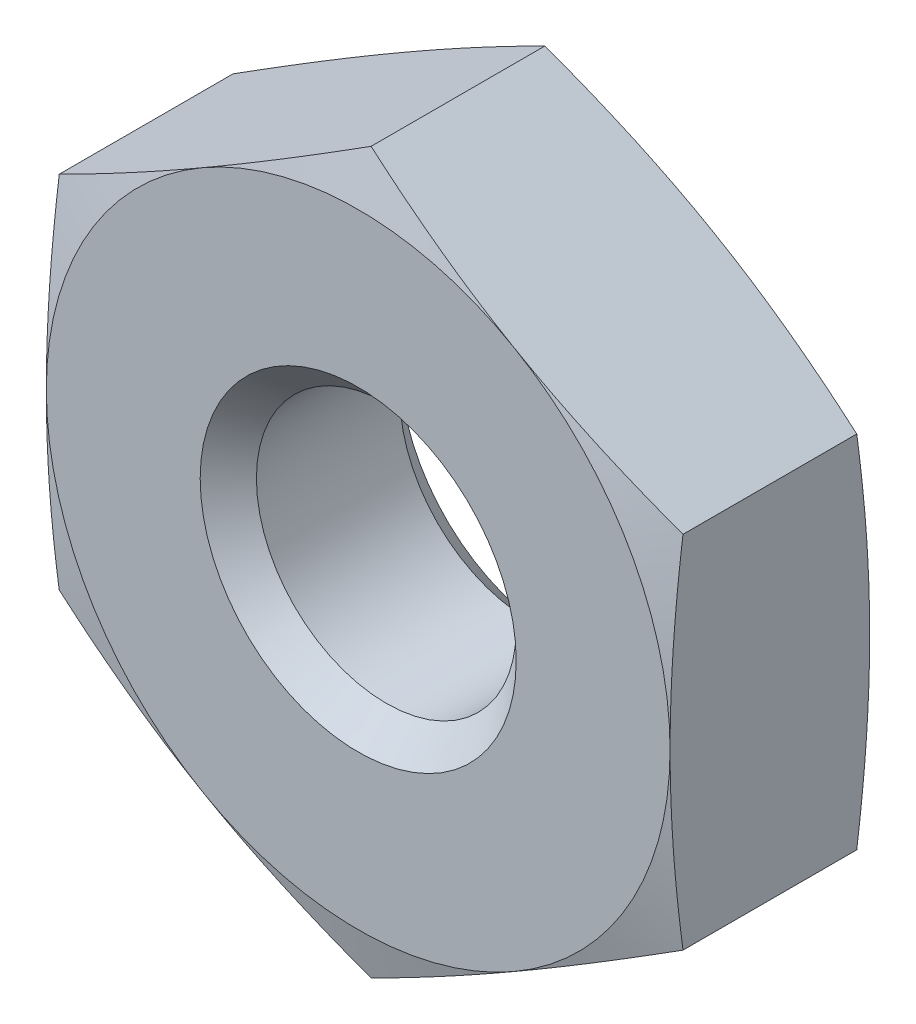
ISO-10303-21;
HEADER;
FILE_DESCRIPTION(('STEP AP214'),'2;1');
FILE_NAME('part.step','',(''),(''),'','','');
FILE_SCHEMA(('AUTOMOTIVE_DESIGN { 1 0 10303 214 1 1 1 1 }'));
ENDSEC;
DATA;
#1=APPLICATION_CONTEXT('core data for automotive mechanical design processes');
#2=APPLICATION_PROTOCOL_DEFINITION('international standard','automotive_design',2000,#1);
#3=PRODUCT_CONTEXT('',#1,'mechanical');
#4=PRODUCT('Part','Part','',(#3));
#5=PRODUCT_RELATED_PRODUCT_CATEGORY('part','',(#4));
#6=PRODUCT_DEFINITION_FORMATION('','',#4);
#7=PRODUCT_DEFINITION_CONTEXT('part definition',#1,'design');
#8=PRODUCT_DEFINITION('design','',#6,#7);
#9=PRODUCT_DEFINITION_SHAPE('','',#8);
#10=(LENGTH_UNIT() NAMED_UNIT(*) SI_UNIT(.MILLI.,.METRE.));
#11=(NAMED_UNIT(*) PLANE_ANGLE_UNIT() SI_UNIT($,.RADIAN.));
#12=(NAMED_UNIT(*) SI_UNIT($,.STERADIAN.) SOLID_ANGLE_UNIT());
#13=UNCERTAINTY_MEASURE_WITH_UNIT(LENGTH_MEASURE(1.E-05),#10,'distance_accuracy_value','');
#14=(GEOMETRIC_REPRESENTATION_CONTEXT(3) GLOBAL_UNCERTAINTY_ASSIGNED_CONTEXT((#13)) GLOBAL_UNIT_ASSIGNED_CONTEXT((#10,
#11,#12)) REPRESENTATION_CONTEXT('',''));
#15=CARTESIAN_POINT('',(0.,0.,0.));
#16=DIRECTION('',(0.,0.,1.));
#17=DIRECTION('',(1.,0.,0.));
#18=AXIS2_PLACEMENT_3D('',#15,#16,#17);
#19=CARTESIAN_POINT('',(0.,0.,0.));
#20=DIRECTION('',(0.,0.,-1.));
#21=DIRECTION('',(-1.,0.,0.));
#22=AXIS2_PLACEMENT_3D('',#19,#20,#21);
#23=PLANE('',#22);
#24=CARTESIAN_POINT('',(0.,0.,0.));
#25=DIRECTION('',(0.,0.,1.));
#26=DIRECTION('',(1.,0.,0.));
#27=AXIS2_PLACEMENT_3D('',#24,#25,#26);
#28=CIRCLE('',#27,2.41299999999001);
#29=CARTESIAN_POINT('',(2.41299999999001,0.,0.));
#30=VERTEX_POINT('',#29);
#31=EDGE_CURVE('E19',#30,#30,#28,.F.);
#32=ORIENTED_EDGE('',*,*,#31,.T.);
#33=EDGE_LOOP('',(#32));
#34=FACE_BOUND('',#33,.T.);
#35=CARTESIAN_POINT('',(0.,0.,0.));
#36=DIRECTION('',(0.,0.,-1.));
#37=DIRECTION('',(0.,1.,0.));
#38=AXIS2_PLACEMENT_3D('',#35,#36,#37);
#39=CIRCLE('',#38,4.7624999999698);
#40=CARTESIAN_POINT('',(-4.7624999999849,0.,-4.04533606351852E-12));
#41=VERTEX_POINT('',#40);
#42=CARTESIAN_POINT('',(-2.38124999999246,4.12444598551032,-4.04657973044043E-12));
#43=VERTEX_POINT('',#42);
#44=EDGE_CURVE('E129',#41,#43,#39,.T.);
#45=ORIENTED_EDGE('',*,*,#44,.F.);
#46=CARTESIAN_POINT('',(0.,0.,0.));
#47=DIRECTION('',(0.,0.,-1.));
#48=DIRECTION('',(0.,1.,0.));
#49=AXIS2_PLACEMENT_3D('',#46,#47,#48);
#50=CIRCLE('',#49,4.7624999999698);
#51=CARTESIAN_POINT('',(-2.38124999999245,-4.12444598551032,-4.04580046008107E-12));
#52=VERTEX_POINT('',#51);
#53=EDGE_CURVE('E127',#52,#41,#50,.T.);
#54=ORIENTED_EDGE('',*,*,#53,.F.);
#55=CARTESIAN_POINT('',(0.,0.,0.));
#56=DIRECTION('',(0.,0.,-1.));
#57=DIRECTION('',(0.,1.,0.));
#58=AXIS2_PLACEMENT_3D('',#55,#56,#57);
#59=CIRCLE('',#58,4.7624999999698);
#60=CARTESIAN_POINT('',(2.38124999999246,-4.12444598551031,-4.04656131367248E-12));
#61=VERTEX_POINT('',#60);
#62=EDGE_CURVE('E109',#61,#52,#59,.T.);
#63=ORIENTED_EDGE('',*,*,#62,.F.);
#64=CARTESIAN_POINT('',(0.,0.,0.));
#65=DIRECTION('',(0.,0.,-1.));
#66=DIRECTION('',(0.,1.,0.));
#67=AXIS2_PLACEMENT_3D('',#64,#65,#66);
#68=CIRCLE('',#67,4.7624999999698);
#69=CARTESIAN_POINT('',(4.7624999999849,0.,-4.04533558540813E-12));
#70=VERTEX_POINT('',#69);
#71=EDGE_CURVE('E102',#70,#61,#68,.T.);
#72=ORIENTED_EDGE('',*,*,#71,.F.);
#73=CARTESIAN_POINT('',(0.,0.,0.));
#74=DIRECTION('',(0.,0.,-1.));
#75=DIRECTION('',(0.,1.,0.));
#76=AXIS2_PLACEMENT_3D('',#73,#74,#75);
#77=CIRCLE('',#76,4.7624999999698);
#78=CARTESIAN_POINT('',(2.38124999999245,4.12444598551031,-4.04582372559714E-12));
#79=VERTEX_POINT('',#78);
#80=EDGE_CURVE('E424',#79,#70,#77,.T.);
#81=ORIENTED_EDGE('',*,*,#80,.F.);
#82=CARTESIAN_POINT('',(0.,0.,0.));
#83=DIRECTION('',(0.,0.,-1.));
#84=DIRECTION('',(0.,1.,0.));
#85=AXIS2_PLACEMENT_3D('',#82,#83,#84);
#86=CIRCLE('',#85,4.7624999999698);
#87=EDGE_CURVE('E134',#43,#79,#86,.T.);
#88=ORIENTED_EDGE('',*,*,#87,.F.);
#89=EDGE_LOOP('',(#45,#54,#63,#72,#81,#88));
#90=FACE_BOUND('',#89,.T.);
#91=ADVANCED_FACE('F16',(#34,#90),#23,.F.);
#92=CARTESIAN_POINT('',(0.,0.,0.));
#93=DIRECTION('',(0.,0.,1.));
#94=DIRECTION('',(1.,0.,0.));
#95=AXIS2_PLACEMENT_3D('',#92,#93,#94);
#96=CONICAL_SURFACE('',#95,2.41299999999001,0.785398163397448);
#97=ORIENTED_EDGE('',*,*,#31,.F.);
#98=EDGE_LOOP('',(#97));
#99=FACE_BOUND('',#98,.T.);
#100=CARTESIAN_POINT('',(0.,0.,-0.42926));
#101=DIRECTION('',(0.,0.,1.));
#102=DIRECTION('',(1.,0.,0.));
#103=AXIS2_PLACEMENT_3D('',#100,#101,#102);
#104=CIRCLE('',#103,1.98374);
#105=CARTESIAN_POINT('',(1.98374,0.,-0.42926));
#106=VERTEX_POINT('',#105);
#107=EDGE_CURVE('E124',#106,#106,#104,.F.);
#108=ORIENTED_EDGE('',*,*,#107,.T.);
#109=EDGE_LOOP('',(#108));
#110=FACE_BOUND('',#109,.T.);
#111=ADVANCED_FACE('F396',(#99,#110),#96,.F.);
#112=CARTESIAN_POINT('',(0.,0.,-0.198599086729701));
#113=DIRECTION('',(0.,0.,-1.));
#114=DIRECTION('',(0.,1.,0.));
#115=AXIS2_PLACEMENT_3D('',#112,#113,#114);
#116=CONICAL_SURFACE('',#115,5.50368188197581,1.30899693899372);
#117=ORIENTED_EDGE('',*,*,#62,.T.);
#118=CARTESIAN_POINT('',(-1.10100781708096E-12,-5.49926131403055,-0.197414599118673));
#119=CARTESIAN_POINT('',(-0.197405840343341,-5.38528899896936,-0.166865512952063));
#120=CARTESIAN_POINT('',(-0.395166009137093,-5.2711121122813,-0.139125457541238));
#121=CARTESIAN_POINT('',(-0.791077990089859,-5.04253222350282,-0.0904103419889045));
#122=CARTESIAN_POINT('',(-0.989229100594217,-4.92812962651291,-0.0694276203508561));
#123=CARTESIAN_POINT('',(-1.38610237940164,-4.69899473215927,-0.0352954826427711));
#124=CARTESIAN_POINT('',(-1.58482467133357,-4.58426236341839,-0.022147914684576));
#125=CARTESIAN_POINT('',(-1.88322873930389,-4.41197869444845,-0.0089070268822042));
#126=CARTESIAN_POINT('',(-1.98280832106101,-4.35448639611518,-0.00557342497592602));
#127=CARTESIAN_POINT('',(-2.18200766587997,-4.23947860076156,-0.00111726033218135));
#128=CARTESIAN_POINT('',(-2.28162743013149,-4.18196310305434,5.23126526352427E-06));
#129=CARTESIAN_POINT('',(-2.38125,-4.12444598552339,-8.09156365887653E-12));
#130=B_SPLINE_CURVE_WITH_KNOTS('',3,(#118,#119,#120,#121,#122,#123,#124,#125,#126,#127,#128,
#129),.UNSPECIFIED.,.F.,.F.,(4,2,2,2,2,4),(0.,0.68997774530214,1.37917041365534,
2.06852558060972,2.41360556986701,2.75869666150886),.UNSPECIFIED.);
#131=CARTESIAN_POINT('',(0.,-5.49926131403055,-0.197414599118673));
#132=VERTEX_POINT('',#131);
#133=EDGE_CURVE('E112',#132,#52,#130,.T.);
#134=ORIENTED_EDGE('',*,*,#133,.F.);
#135=CARTESIAN_POINT('',(2.38125000000001,-4.1244459855234,-8.09310346985567E-12));
#136=CARTESIAN_POINT('',(2.2816274301315,-4.18196310305434,5.23126526195123E-06));
#137=CARTESIAN_POINT('',(2.18200766587997,-4.23947860076157,-0.00111726033218282));
#138=CARTESIAN_POINT('',(1.98280832106102,-4.35448639611519,-0.00557342497592722));
#139=CARTESIAN_POINT('',(1.8832287393039,-4.41197869444845,-0.00890702688220526));
#140=CARTESIAN_POINT('',(1.58482467133357,-4.5842623634184,-0.0221479146845768));
#141=CARTESIAN_POINT('',(1.38610237940164,-4.69899473215928,-0.0352954826427721));
#142=CARTESIAN_POINT('',(0.989229100594223,-4.92812962651291,-0.0694276203508573));
#143=CARTESIAN_POINT('',(0.791077990089865,-5.04253222350282,-0.0904103419889056));
#144=CARTESIAN_POINT('',(0.395166009137099,-5.2711121122813,-0.139125457541239));
#145=CARTESIAN_POINT('',(0.197405840343347,-5.38528899896936,-0.166865512952064));
#146=CARTESIAN_POINT('',(1.10691644819718E-12,-5.49926131403056,-0.197414599118673));
#147=B_SPLINE_CURVE_WITH_KNOTS('',3,(#135,#136,#137,#138,#139,#140,#141,#142,#143,#144,#145,
#146),.UNSPECIFIED.,.F.,.F.,(4,2,2,2,2,4),(0.,0.345091091641847,0.690171080899136,
1.37952624785352,2.06871891620672,2.75869666150886),.UNSPECIFIED.);
#148=EDGE_CURVE('E114',#61,#132,#147,.T.);
#149=ORIENTED_EDGE('',*,*,#148,.F.);
#150=EDGE_LOOP('',(#117,#134,#149));
#151=FACE_BOUND('',#150,.T.);
#152=ADVANCED_FACE('F111',(#151),#116,.T.);
#153=CARTESIAN_POINT('',(0.,0.,-0.198599086729701));
#154=DIRECTION('',(0.,0.,-1.));
#155=DIRECTION('',(0.,1.,0.));
#156=AXIS2_PLACEMENT_3D('',#153,#154,#155);
#157=CONICAL_SURFACE('',#156,5.50368188197581,1.30899693899372);
#158=ORIENTED_EDGE('',*,*,#71,.T.);
#159=CARTESIAN_POINT('',(4.7624999999989,-2.74963065701624,-0.197414599118673));
#160=CARTESIAN_POINT('',(4.56509415965666,-2.86360297207744,-0.166865512952064));
#161=CARTESIAN_POINT('',(4.36733399086291,-2.97777985876549,-0.139125457541239));
#162=CARTESIAN_POINT('',(3.97142200991014,-3.20635974754397,-0.0904103419889058));
#163=CARTESIAN_POINT('',(3.77327089940579,-3.32076234453388,-0.0694276203508575));
#164=CARTESIAN_POINT('',(3.37639762059837,-3.54989723888751,-0.0352954826427724));
#165=CARTESIAN_POINT('',(3.17767532866644,-3.66462960762839,-0.0221479146845772));
#166=CARTESIAN_POINT('',(2.87927126069612,-3.83691327659834,-0.00890702688220558));
#167=CARTESIAN_POINT('',(2.77969167893899,-3.8944055749316,-0.00557342497592748));
#168=CARTESIAN_POINT('',(2.58049233412004,-4.00941337028522,-0.00111726033218291));
#169=CARTESIAN_POINT('',(2.48087256986852,-4.06692886799245,5.23126526196898E-06));
#170=CARTESIAN_POINT('',(2.38125000000001,-4.1244459855234,-8.09294901954408E-12));
#171=B_SPLINE_CURVE_WITH_KNOTS('',3,(#159,#160,#161,#162,#163,#164,#165,#166,#167,#168,#169,
#170),.UNSPECIFIED.,.F.,.F.,(4,2,2,2,2,4),(0.,0.689977745302137,1.37917041365533,
2.06852558060971,2.413605569867,2.75869666150884),.UNSPECIFIED.);
#172=CARTESIAN_POINT('',(4.76249999999945,-2.74963065701528,-0.197414599118673));
#173=VERTEX_POINT('',#172);
#174=EDGE_CURVE('E138',#173,#61,#171,.T.);
#175=ORIENTED_EDGE('',*,*,#174,.F.);
#176=CARTESIAN_POINT('',(4.7625,0.,-8.09065780609849E-12));
#177=CARTESIAN_POINT('',(4.7625,-0.115034235061893,5.23126526450705E-06));
#178=CARTESIAN_POINT('',(4.7625,-0.230065230476342,-0.00111726033218035));
#179=CARTESIAN_POINT('',(4.7625,-0.460080821183584,-0.00557342497592502));
#180=CARTESIAN_POINT('',(4.7625,-0.575065417850113,-0.00890702688220324));
#181=CARTESIAN_POINT('',(4.7625,-0.919632755790004,-0.0221479146845751));
#182=CARTESIAN_POINT('',(4.7625,-1.14909749327177,-0.0352954826427701));
#183=CARTESIAN_POINT('',(4.7625,-1.60736728197903,-0.0694276203508552));
#184=CARTESIAN_POINT('',(4.7625,-1.83617247595886,-0.0904103419889037));
#185=CARTESIAN_POINT('',(4.7625,-2.29333225351581,-0.139125457541237));
#186=CARTESIAN_POINT('',(4.7625,-2.52168602689193,-0.166865512952062));
#187=CARTESIAN_POINT('',(4.7625,-2.74963065701432,-0.197414599118672));
#188=B_SPLINE_CURVE_WITH_KNOTS('',3,(#176,#177,#178,#179,#180,#181,#182,#183,#184,#185,#186,
#187),.UNSPECIFIED.,.F.,.F.,(4,2,2,2,2,4),(0.,0.345091091641847,0.690171080899136,
1.37952624785352,2.06871891620672,2.75869666150886),.UNSPECIFIED.);
#189=EDGE_CURVE('E320',#70,#173,#188,.T.);
#190=ORIENTED_EDGE('',*,*,#189,.F.);
#191=EDGE_LOOP('',(#158,#175,#190));
#192=FACE_BOUND('',#191,.T.);
#193=ADVANCED_FACE('F388',(#192),#157,.T.);
#194=CARTESIAN_POINT('',(0.,0.,-0.198599086729701));
#195=DIRECTION('',(0.,0.,-1.));
#196=DIRECTION('',(0.,1.,0.));
#197=AXIS2_PLACEMENT_3D('',#194,#195,#196);
#198=CONICAL_SURFACE('',#197,5.50368188197581,1.30899693899372);
#199=ORIENTED_EDGE('',*,*,#80,.T.);
#200=CARTESIAN_POINT('',(4.7625,2.74963065701432,-0.197414599118672));
#201=CARTESIAN_POINT('',(4.7625,2.52168602689193,-0.166865512952062));
#202=CARTESIAN_POINT('',(4.7625,2.29333225351581,-0.139125457541237));
#203=CARTESIAN_POINT('',(4.7625,1.83617247595886,-0.0904103419889038));
#204=CARTESIAN_POINT('',(4.7625,1.60736728197903,-0.0694276203508553));
#205=CARTESIAN_POINT('',(4.7625,1.14909749327176,-0.0352954826427701));
#206=CARTESIAN_POINT('',(4.7625,0.919632755790003,-0.022147914684575));
#207=CARTESIAN_POINT('',(4.7625,0.575065417850113,-0.0089070268822032));
#208=CARTESIAN_POINT('',(4.7625,0.460080821183584,-0.005573424975925));
#209=CARTESIAN_POINT('',(4.7625,0.230065230476342,-0.00111726033218035));
#210=CARTESIAN_POINT('',(4.7625,0.115034235061893,5.23126526450129E-06));
#211=CARTESIAN_POINT('',(4.7625,0.,-8.09064406576194E-12));
#212=B_SPLINE_CURVE_WITH_KNOTS('',3,(#200,#201,#202,#203,#204,#205,#206,#207,#208,#209,#210,
#211),.UNSPECIFIED.,.F.,.F.,(4,2,2,2,2,4),(0.,0.68997774530214,1.37917041365534,
2.06852558060972,2.41360556986701,2.75869666150886),.UNSPECIFIED.);
#213=CARTESIAN_POINT('',(4.76249999999945,2.74963065701528,-0.197414599118672));
#214=VERTEX_POINT('',#213);
#215=EDGE_CURVE('E316',#214,#70,#212,.T.);
#216=ORIENTED_EDGE('',*,*,#215,.F.);
#217=CARTESIAN_POINT('',(2.38125,4.12444598552339,-8.09151740188484E-12));
#218=CARTESIAN_POINT('',(2.48087256986851,4.06692886799244,5.23126526366738E-06));
#219=CARTESIAN_POINT('',(2.58049233412004,4.00941337028522,-0.00111726033218119));
#220=CARTESIAN_POINT('',(2.77969167893899,3.8944055749316,-0.0055734249759259));
#221=CARTESIAN_POINT('',(2.87927126069611,3.83691327659834,-0.00890702688220413));
#222=CARTESIAN_POINT('',(3.17767532866643,3.66462960762839,-0.022147914684576));
#223=CARTESIAN_POINT('',(3.37639762059837,3.54989723888751,-0.0352954826427711));
#224=CARTESIAN_POINT('',(3.77327089940578,3.32076234453388,-0.0694276203508561));
#225=CARTESIAN_POINT('',(3.97142200991014,3.20635974754397,-0.0904103419889044));
#226=CARTESIAN_POINT('',(4.3673339908629,2.97777985876549,-0.139125457541237));
#227=CARTESIAN_POINT('',(4.56509415965665,2.86360297207743,-0.166865512952062));
#228=CARTESIAN_POINT('',(4.76249999999889,2.74963065701623,-0.197414599118672));
#229=B_SPLINE_CURVE_WITH_KNOTS('',3,(#217,#218,#219,#220,#221,#222,#223,#224,#225,#226,#227,
#228),.UNSPECIFIED.,.F.,.F.,(4,2,2,2,2,4),(0.,0.345091091641846,0.690171080899133,
1.37952624785351,2.06871891620671,2.75869666150884),.UNSPECIFIED.);
#230=EDGE_CURVE('E324',#79,#214,#229,.T.);
#231=ORIENTED_EDGE('',*,*,#230,.F.);
#232=EDGE_LOOP('',(#199,#216,#231));
#233=FACE_BOUND('',#232,.T.);
#234=ADVANCED_FACE('F391',(#233),#198,.T.);
#235=CARTESIAN_POINT('',(0.,0.,-0.198599086729701));
#236=DIRECTION('',(0.,0.,-1.));
#237=DIRECTION('',(0.,1.,0.));
#238=AXIS2_PLACEMENT_3D('',#235,#236,#237);
#239=CONICAL_SURFACE('',#238,5.50368188197581,1.30899693899372);
#240=CARTESIAN_POINT('',(-2.38125000000001,4.1244459855234,-8.09315141584367E-12));
#241=CARTESIAN_POINT('',(-2.2816274301315,4.18196310305434,5.23126526194159E-06));
#242=CARTESIAN_POINT('',(-2.18200766587997,4.23947860076157,-0.00111726033218282));
#243=CARTESIAN_POINT('',(-1.98280832106102,4.35448639611519,-0.00557342497592722));
#244=CARTESIAN_POINT('',(-1.8832287393039,4.41197869444845,-0.00890702688220527));
#245=CARTESIAN_POINT('',(-1.58482467133357,4.5842623634184,-0.0221479146845769));
#246=CARTESIAN_POINT('',(-1.38610237940164,4.69899473215928,-0.0352954826427721));
#247=CARTESIAN_POINT('',(-0.989229100594223,4.92812962651291,-0.0694276203508573));
#248=CARTESIAN_POINT('',(-0.791077990089865,5.04253222350282,-0.0904103419889056));
#249=CARTESIAN_POINT('',(-0.395166009137099,5.2711121122813,-0.139125457541239));
#250=CARTESIAN_POINT('',(-0.197405840343347,5.38528899896936,-0.166865512952064));
#251=CARTESIAN_POINT('',(-1.10691644819718E-12,5.49926131403056,-0.197414599118673));
#252=B_SPLINE_CURVE_WITH_KNOTS('',3,(#240,#241,#242,#243,#244,#245,#246,#247,#248,#249,#250,
#251),.UNSPECIFIED.,.F.,.F.,(4,2,2,2,2,4),(0.,0.345091091641847,0.690171080899136,
1.37952624785352,2.06871891620672,2.75869666150886),.UNSPECIFIED.);
#253=CARTESIAN_POINT('',(0.,5.49926131403055,-0.197414599118673));
#254=VERTEX_POINT('',#253);
#255=EDGE_CURVE('E182',#43,#254,#252,.T.);
#256=ORIENTED_EDGE('',*,*,#255,.F.);
#257=ORIENTED_EDGE('',*,*,#87,.T.);
#258=CARTESIAN_POINT('',(1.1017532977768E-12,5.49926131403055,-0.197414599118673));
#259=CARTESIAN_POINT('',(0.197405840343342,5.38528899896935,-0.166865512952063));
#260=CARTESIAN_POINT('',(0.395166009137094,5.2711121122813,-0.139125457541237));
#261=CARTESIAN_POINT('',(0.79107799008986,5.04253222350282,-0.0904103419889044));
#262=CARTESIAN_POINT('',(0.989229100594218,4.92812962651291,-0.0694276203508561));
#263=CARTESIAN_POINT('',(1.38610237940164,4.69899473215927,-0.035295482642771));
#264=CARTESIAN_POINT('',(1.58482467133357,4.58426236341839,-0.0221479146845757));
#265=CARTESIAN_POINT('',(1.88322873930389,4.41197869444845,-0.00890702688220403));
#266=CARTESIAN_POINT('',(1.98280832106101,4.35448639611518,-0.00557342497592598));
#267=CARTESIAN_POINT('',(2.18200766587997,4.23947860076156,-0.0011172603321815));
#268=CARTESIAN_POINT('',(2.28162743013149,4.18196310305434,5.23126526332879E-06));
#269=CARTESIAN_POINT('',(2.38125,4.12444598552339,-8.09160046136907E-12));
#270=B_SPLINE_CURVE_WITH_KNOTS('',3,(#258,#259,#260,#261,#262,#263,#264,#265,#266,#267,#268,
#269),.UNSPECIFIED.,.F.,.F.,(4,2,2,2,2,4),(0.,0.68997774530214,1.37917041365534,
2.06852558060972,2.41360556986701,2.75869666150886),.UNSPECIFIED.);
#271=EDGE_CURVE('E319',#254,#79,#270,.T.);
#272=ORIENTED_EDGE('',*,*,#271,.F.);
#273=EDGE_LOOP('',(#256,#257,#272));
#274=FACE_BOUND('',#273,.T.);
#275=ADVANCED_FACE('F164',(#274),#239,.T.);
#276=CARTESIAN_POINT('',(0.,0.,-0.198599086729701));
#277=DIRECTION('',(0.,0.,-1.));
#278=DIRECTION('',(0.,1.,0.));
#279=AXIS2_PLACEMENT_3D('',#276,#277,#278);
#280=CONICAL_SURFACE('',#279,5.50368188197581,1.30899693899372);
#281=CARTESIAN_POINT('',(-2.38125,-4.12444598552339,-8.09163584341431E-12));
#282=CARTESIAN_POINT('',(-2.48087256986851,-4.06692886799244,5.23126526345237E-06));
#283=CARTESIAN_POINT('',(-2.58049233412004,-4.00941337028522,-0.00111726033218138));
#284=CARTESIAN_POINT('',(-2.77969167893899,-3.8944055749316,-0.00557342497592596));
#285=CARTESIAN_POINT('',(-2.87927126069611,-3.83691327659834,-0.0089070268822041));
#286=CARTESIAN_POINT('',(-3.17767532866643,-3.66462960762839,-0.0221479146845759));
#287=CARTESIAN_POINT('',(-3.37639762059837,-3.54989723888751,-0.0352954826427711));
#288=CARTESIAN_POINT('',(-3.77327089940578,-3.32076234453388,-0.0694276203508561));
#289=CARTESIAN_POINT('',(-3.97142200991014,-3.20635974754397,-0.0904103419889043));
#290=CARTESIAN_POINT('',(-4.3673339908629,-2.97777985876549,-0.139125457541237));
#291=CARTESIAN_POINT('',(-4.56509415965665,-2.86360297207743,-0.166865512952062));
#292=CARTESIAN_POINT('',(-4.76249999999889,-2.74963065701623,-0.197414599118672));
#293=B_SPLINE_CURVE_WITH_KNOTS('',3,(#281,#282,#283,#284,#285,#286,#287,#288,#289,#290,#291,
#292),.UNSPECIFIED.,.F.,.F.,(4,2,2,2,2,4),(0.,0.345091091641846,0.690171080899134,
1.37952624785351,2.06871891620671,2.75869666150885),.UNSPECIFIED.);
#294=CARTESIAN_POINT('',(-4.76249999999945,-2.74963065701592,-0.197414599118757));
#295=VERTEX_POINT('',#294);
#296=EDGE_CURVE('E121',#52,#295,#293,.T.);
#297=ORIENTED_EDGE('',*,*,#296,.F.);
#298=ORIENTED_EDGE('',*,*,#53,.T.);
#299=CARTESIAN_POINT('',(-4.7625,-2.74963065701432,-0.197414599118672));
#300=CARTESIAN_POINT('',(-4.7625,-2.52168602689193,-0.166865512952062));
#301=CARTESIAN_POINT('',(-4.7625,-2.29333225351581,-0.139125457541237));
#302=CARTESIAN_POINT('',(-4.7625,-1.83617247595886,-0.0904103419889037));
#303=CARTESIAN_POINT('',(-4.7625,-1.60736728197903,-0.0694276203508553));
#304=CARTESIAN_POINT('',(-4.7625,-1.14909749327177,-0.0352954826427701));
#305=CARTESIAN_POINT('',(-4.7625,-0.919632755790004,-0.022147914684575));
#306=CARTESIAN_POINT('',(-4.7625,-0.575065417850113,-0.00890702688220322));
#307=CARTESIAN_POINT('',(-4.7625,-0.460080821183584,-0.00557342497592502));
#308=CARTESIAN_POINT('',(-4.7625,-0.230065230476342,-0.00111726033218037));
#309=CARTESIAN_POINT('',(-4.7625,-0.115034235061893,5.23126526449092E-06));
#310=CARTESIAN_POINT('',(-4.7625,0.,-8.09061696076563E-12));
#311=B_SPLINE_CURVE_WITH_KNOTS('',3,(#299,#300,#301,#302,#303,#304,#305,#306,#307,#308,#309,
#310),.UNSPECIFIED.,.F.,.F.,(4,2,2,2,2,4),(0.,0.68997774530214,1.37917041365534,
2.06852558060972,2.41360556986701,2.75869666150886),.UNSPECIFIED.);
#312=EDGE_CURVE('E137',#295,#41,#311,.T.);
#313=ORIENTED_EDGE('',*,*,#312,.F.);
#314=EDGE_LOOP('',(#297,#298,#313));
#315=FACE_BOUND('',#314,.T.);
#316=ADVANCED_FACE('F136',(#315),#280,.T.);
#317=CARTESIAN_POINT('',(0.,0.,-0.198599086729701));
#318=DIRECTION('',(0.,0.,-1.));
#319=DIRECTION('',(0.,1.,0.));
#320=AXIS2_PLACEMENT_3D('',#317,#318,#319);
#321=CONICAL_SURFACE('',#320,5.50368188197581,1.30899693899372);
#322=ORIENTED_EDGE('',*,*,#44,.T.);
#323=CARTESIAN_POINT('',(-4.7624999999989,2.74963065701624,-0.197414599118673));
#324=CARTESIAN_POINT('',(-4.56509415965666,2.86360297207744,-0.166865512952064));
#325=CARTESIAN_POINT('',(-4.36733399086291,2.97777985876549,-0.139125457541239));
#326=CARTESIAN_POINT('',(-3.97142200991014,3.20635974754397,-0.0904103419889058));
#327=CARTESIAN_POINT('',(-3.77327089940579,3.32076234453388,-0.0694276203508575));
#328=CARTESIAN_POINT('',(-3.37639762059837,3.54989723888751,-0.0352954826427724));
#329=CARTESIAN_POINT('',(-3.17767532866644,3.66462960762839,-0.0221479146845773));
#330=CARTESIAN_POINT('',(-2.87927126069612,3.83691327659834,-0.00890702688220558));
#331=CARTESIAN_POINT('',(-2.77969167893899,3.8944055749316,-0.00557342497592747));
#332=CARTESIAN_POINT('',(-2.58049233412004,4.00941337028522,-0.00111726033218289));
#333=CARTESIAN_POINT('',(-2.48087256986852,4.06692886799245,5.23126526199242E-06));
#334=CARTESIAN_POINT('',(-2.38125000000001,4.1244459855234,-8.09294806332329E-12));
#335=B_SPLINE_CURVE_WITH_KNOTS('',3,(#323,#324,#325,#326,#327,#328,#329,#330,#331,#332,#333,
#334),.UNSPECIFIED.,.F.,.F.,(4,2,2,2,2,4),(0.,0.689977745302137,1.37917041365533,
2.06852558060971,2.413605569867,2.75869666150884),.UNSPECIFIED.);
#336=CARTESIAN_POINT('',(-4.76249999999945,2.74963065701528,-0.197414599118673));
#337=VERTEX_POINT('',#336);
#338=EDGE_CURVE('E323',#337,#43,#335,.T.);
#339=ORIENTED_EDGE('',*,*,#338,.F.);
#340=CARTESIAN_POINT('',(-4.7625,0.,-8.09065780609849E-12));
#341=CARTESIAN_POINT('',(-4.7625,0.115034235061893,5.23126526450624E-06));
#342=CARTESIAN_POINT('',(-4.7625,0.230065230476342,-0.00111726033218034));
#343=CARTESIAN_POINT('',(-4.7625,0.460080821183584,-0.00557342497592502));
#344=CARTESIAN_POINT('',(-4.7625,0.575065417850113,-0.00890702688220323));
#345=CARTESIAN_POINT('',(-4.7625,0.919632755790004,-0.0221479146845751));
#346=CARTESIAN_POINT('',(-4.7625,1.14909749327177,-0.0352954826427701));
#347=CARTESIAN_POINT('',(-4.7625,1.60736728197903,-0.0694276203508552));
#348=CARTESIAN_POINT('',(-4.7625,1.83617247595886,-0.0904103419889037));
#349=CARTESIAN_POINT('',(-4.7625,2.29333225351581,-0.139125457541237));
#350=CARTESIAN_POINT('',(-4.7625,2.52168602689193,-0.166865512952062));
#351=CARTESIAN_POINT('',(-4.7625,2.74963065701432,-0.197414599118672));
#352=B_SPLINE_CURVE_WITH_KNOTS('',3,(#340,#341,#342,#343,#344,#345,#346,#347,#348,#349,#350,
#351),.UNSPECIFIED.,.F.,.F.,(4,2,2,2,2,4),(0.,0.345091091641847,0.690171080899136,
1.37952624785352,2.06871891620672,2.75869666150886),.UNSPECIFIED.);
#353=EDGE_CURVE('E176',#41,#337,#352,.T.);
#354=ORIENTED_EDGE('',*,*,#353,.F.);
#355=EDGE_LOOP('',(#322,#339,#354));
#356=FACE_BOUND('',#355,.T.);
#357=ADVANCED_FACE('F163',(#356),#321,.T.);
#358=CARTESIAN_POINT('',(0.,0.,-3.048));
#359=DIRECTION('',(0.,0.,1.));
#360=DIRECTION('',(1.,0.,0.));
#361=AXIS2_PLACEMENT_3D('',#358,#359,#360);
#362=CYLINDRICAL_SURFACE('',#361,1.98374);
#363=ORIENTED_EDGE('',*,*,#107,.F.);
#364=EDGE_LOOP('',(#363));
#365=FACE_BOUND('',#364,.T.);
#366=CARTESIAN_POINT('',(0.,0.,-2.61874000000262));
#367=DIRECTION('',(0.,0.,-1.));
#368=DIRECTION('',(-1.,0.,0.));
#369=AXIS2_PLACEMENT_3D('',#366,#367,#368);
#370=CIRCLE('',#369,1.98373999995738);
#371=CARTESIAN_POINT('',(-1.98373999995738,0.,-2.61874000000262));
#372=VERTEX_POINT('',#371);
#373=EDGE_CURVE('E215',#372,#372,#370,.T.);
#374=ORIENTED_EDGE('',*,*,#373,.T.);
#375=EDGE_LOOP('',(#374));
#376=FACE_BOUND('',#375,.T.);
#377=ADVANCED_FACE('F335',(#365,#376),#362,.F.);
#378=CARTESIAN_POINT('',(-4.7625,-2.7496306570156,-3.048));
#379=DIRECTION('',(-0.5,-0.866025403784439,0.));
#380=DIRECTION('',(0.866025403784439,-0.5,0.));
#381=AXIS2_PLACEMENT_3D('',#378,#379,#380);
#382=PLANE('',#381);
#383=CARTESIAN_POINT('',(3.96377688690681E-08,-5.49926133691606,-2.85058539480885));
#384=CARTESIAN_POINT('',(-0.197405803966096,-5.38528901997177,-2.88113448186259));
#385=CARTESIAN_POINT('',(-0.39516597603361,-5.2711121313936,-2.90887453810665));
#386=CARTESIAN_POINT('',(-0.791077963548569,-5.04253223882644,-2.95758965515473));
#387=CARTESIAN_POINT('',(-0.989229077341312,-4.92812963993798,-2.97857237745567));
#388=CARTESIAN_POINT('',(-1.38610236275268,-4.69899474177155,-3.01270451626038));
#389=CARTESIAN_POINT('',(-1.58482465800018,-4.58426237111643,-3.02585208465216));
#390=CARTESIAN_POINT('',(-1.88322873095886,-4.41197869926645,-3.03909297289422));
#391=CARTESIAN_POINT('',(-1.98280831438369,-4.35448639997034,-3.04242657491196));
#392=CARTESIAN_POINT('',(-2.18200766254018,-4.23947860268979,-3.04688273970508));
#393=CARTESIAN_POINT('',(-2.28162742846153,-4.18196310401849,-3.04800523134043));
#394=CARTESIAN_POINT('',(-2.38125000000001,-4.12444598552339,-3.04800000006672));
#395=B_SPLINE_CURVE_WITH_KNOTS('',3,(#383,#384,#385,#386,#387,#388,#389,#390,#391,#392,#393,
#394),.UNSPECIFIED.,.F.,.F.,(4,2,2,2,2,4),(0.,0.689977756856798,1.37917043673169,
2.06852561521938,2.4136056102601,2.7586967076863),.UNSPECIFIED.);
#396=CARTESIAN_POINT('',(4.18420839586607E-08,-5.49926128987366,-2.85058540741382));
#397=VERTEX_POINT('',#396);
#398=CARTESIAN_POINT('',(-2.38124999999246,-4.12444598551031,-3.04800000007077));
#399=VERTEX_POINT('',#398);
#400=EDGE_CURVE('E236',#397,#399,#395,.T.);
#401=ORIENTED_EDGE('',*,*,#400,.F.);
#402=DIRECTION('',(0.,0.,1.));
#403=VECTOR('',#402,1.);
#404=CARTESIAN_POINT('',(0.,-5.49926131403119,-3.048));
#405=LINE('',#404,#403);
#406=EDGE_CURVE('E123',#132,#397,#405,.F.);
#407=ORIENTED_EDGE('',*,*,#406,.F.);
#408=ORIENTED_EDGE('',*,*,#133,.T.);
#409=ORIENTED_EDGE('',*,*,#296,.T.);
#410=DIRECTION('',(0.,0.,1.));
#411=VECTOR('',#410,1.);
#412=CARTESIAN_POINT('',(-4.7625,-2.7496306570156,-3.048));
#413=LINE('',#412,#411);
#414=CARTESIAN_POINT('',(-4.76250001982401,-2.7496306455702,-2.85058539787405));
#415=VERTEX_POINT('',#414);
#416=EDGE_CURVE('E286',#415,#295,#413,.T.);
#417=ORIENTED_EDGE('',*,*,#416,.F.);
#418=CARTESIAN_POINT('',(-2.38125000000001,-4.12444598552339,-3.04800000006672));
#419=CARTESIAN_POINT('',(-2.48087257153892,-4.06692886702804,-3.04800523134043));
#420=CARTESIAN_POINT('',(-2.5804923374607,-4.00941336835649,-3.04688273970507));
#421=CARTESIAN_POINT('',(-2.77969168561804,-3.89440557107545,-3.04242657491191));
#422=CARTESIAN_POINT('',(-2.8792712690433,-3.83691327177908,-3.03909297289415));
#423=CARTESIAN_POINT('',(-3.17767534200327,-3.66462959992836,-3.02585208465197));
#424=CARTESIAN_POINT('',(-3.37639763725163,-3.54989722927274,-3.01270451626008));
#425=CARTESIAN_POINT('',(-3.7732709226647,-3.32076233110533,-2.97857237745508));
#426=CARTESIAN_POINT('',(-3.9714220364583,-3.20635973221638,-2.95758965515397));
#427=CARTESIAN_POINT('',(-4.36733402397495,-2.97777983964824,-2.90887453810551));
#428=CARTESIAN_POINT('',(-4.56509419604331,-2.86360295106959,-2.88113448186123));
#429=CARTESIAN_POINT('',(-4.76250003964801,-2.7496306341248,-2.85058539480726));
#430=B_SPLINE_CURVE_WITH_KNOTS('',3,(#418,#419,#420,#421,#422,#423,#424,#425,#426,#427,#428,
#429),.UNSPECIFIED.,.F.,.F.,(4,2,2,2,2,4),(0.,0.345091097427699,0.690171092469904,
1.37952627096058,2.06871895083844,2.75869670769822),.UNSPECIFIED.);
#431=EDGE_CURVE('E214',#399,#415,#430,.T.);
#432=ORIENTED_EDGE('',*,*,#431,.F.);
#433=EDGE_LOOP('',(#401,#407,#408,#409,#417,#432));
#434=FACE_BOUND('',#433,.T.);
#435=ADVANCED_FACE('F119',(#434),#382,.T.);
#436=CARTESIAN_POINT('',(0.,-5.49926131403119,-3.048));
#437=DIRECTION('',(0.5,-0.866025403784439,0.));
#438=DIRECTION('',(0.866025403784439,0.5,0.));
#439=AXIS2_PLACEMENT_3D('',#436,#437,#438);
#440=PLANE('',#439);
#441=CARTESIAN_POINT('',(4.76250003963458,-2.74963063413257,-2.85058539480934));
#442=CARTESIAN_POINT('',(4.56509419603097,-2.86360295107671,-2.88113448186301));
#443=CARTESIAN_POINT('',(4.36733402396372,-2.97777983965473,-2.908874538107));
#444=CARTESIAN_POINT('',(3.9714220364493,-3.20635973222158,-2.95758965515496));
#445=CARTESIAN_POINT('',(3.77327092265682,-3.32076233110989,-2.97857237745585));
#446=CARTESIAN_POINT('',(3.37639763724599,-3.54989722927601,-3.01270451626047));
#447=CARTESIAN_POINT('',(3.17767534199875,-3.66462959993098,-3.02585208465222));
#448=CARTESIAN_POINT('',(2.87927126904048,-3.83691327178072,-3.03909297289425));
#449=CARTESIAN_POINT('',(2.77969168561578,-3.89440557107676,-3.04242657491197));
#450=CARTESIAN_POINT('',(2.58049233745956,-4.00941336835715,-3.04688273970508));
#451=CARTESIAN_POINT('',(2.48087257153835,-4.06692886702837,-3.04800523134042));
#452=CARTESIAN_POINT('',(2.38125000000001,-4.1244459855234,-3.04800000006672));
#453=B_SPLINE_CURVE_WITH_KNOTS('',3,(#441,#442,#443,#444,#445,#446,#447,#448,#449,#450,#451,
#452),.UNSPECIFIED.,.F.,.F.,(4,2,2,2,2,4),(0.,0.689977756855864,1.37917043672982,
2.06852561521659,2.41360561025683,2.75869670768257),.UNSPECIFIED.);
#454=CARTESIAN_POINT('',(4.7625,-2.74963060870237,-2.85058540741358));
#455=VERTEX_POINT('',#454);
#456=CARTESIAN_POINT('',(2.38124999999245,-4.12444598551032,-3.04800000007077));
#457=VERTEX_POINT('',#456);
#458=EDGE_CURVE('E261',#455,#457,#453,.T.);
#459=ORIENTED_EDGE('',*,*,#458,.F.);
#460=DIRECTION('',(0.,0.,-1.));
#461=VECTOR('',#460,1.);
#462=CARTESIAN_POINT('',(4.7625,-2.7496306570156,-3.048));
#463=LINE('',#462,#461);
#464=EDGE_CURVE('E317',#173,#455,#463,.T.);
#465=ORIENTED_EDGE('',*,*,#464,.F.);
#466=ORIENTED_EDGE('',*,*,#174,.T.);
#467=ORIENTED_EDGE('',*,*,#148,.T.);
#468=ORIENTED_EDGE('',*,*,#406,.T.);
#469=CARTESIAN_POINT('',(2.38125000000001,-4.1244459855234,-3.04800000006672));
#470=CARTESIAN_POINT('',(2.28162743365684,-4.18196310101898,-3.04800523133935));
#471=CARTESIAN_POINT('',(2.18200767293035,-4.23947859669103,-3.04688273982166));
#472=CARTESIAN_POINT('',(1.98280833515701,-4.35448638797686,-3.04242657549217));
#473=CARTESIAN_POINT('',(1.88322875692048,-4.41197868427751,-3.03909297382039));
#474=CARTESIAN_POINT('',(1.5848246994809,-4.58426234716753,-3.02585208694308));
#475=CARTESIAN_POINT('',(1.38610241454846,-4.69899471186725,-3.01270451989707));
#476=CARTESIAN_POINT('',(0.989229149682876,-4.92812959817156,-2.97857238449593));
#477=CARTESIAN_POINT('',(0.791078046120885,-5.0425321911533,-2.95758966425233));
#478=CARTESIAN_POINT('',(0.395166079022261,-5.27111207193308,-2.90887455184612));
#479=CARTESIAN_POINT('',(0.197405917140188,-5.38528895463068,-2.88113449818779));
#480=CARTESIAN_POINT('',(8.36841674310951E-08,-5.49926126571612,-2.85058541388682));
#481=B_SPLINE_CURVE_WITH_KNOTS('',3,(#469,#470,#471,#472,#473,#474,#475,#476,#477,#478,#479,
#480),.UNSPECIFIED.,.F.,.F.,(4,2,2,2,2,4),(0.,0.345091079430938,0.690171056479286,
1.3795261990862,2.06871884311639,2.75869656402629),.UNSPECIFIED.);
#482=EDGE_CURVE('E241',#457,#397,#481,.T.);
#483=ORIENTED_EDGE('',*,*,#482,.F.);
#484=EDGE_LOOP('',(#459,#465,#466,#467,#468,#483));
#485=FACE_BOUND('',#484,.T.);
#486=ADVANCED_FACE('F246',(#485),#440,.T.);
#487=CARTESIAN_POINT('',(4.7625,-2.7496306570156,-3.048));
#488=DIRECTION('',(1.,0.,0.));
#489=DIRECTION('',(0.,0.,-1.));
#490=AXIS2_PLACEMENT_3D('',#487,#488,#489);
#491=PLANE('',#490);
#492=CARTESIAN_POINT('',(4.7625,2.74963070278343,-2.85058539480911));
#493=CARTESIAN_POINT('',(4.7625,2.52168606889499,-2.88113448186281));
#494=CARTESIAN_POINT('',(4.7625,2.29333229173882,-2.90887453810684));
#495=CARTESIAN_POINT('',(4.7625,1.83617250660481,-2.95758965515485));
#496=CARTESIAN_POINT('',(4.7625,1.60736730882805,-2.97857237745576));
#497=CARTESIAN_POINT('',(4.7625,1.14909751249552,-3.01270451626043));
#498=CARTESIAN_POINT('',(4.7625,0.919632771185427,-3.02585208465219));
#499=CARTESIAN_POINT('',(4.7625,0.575065427485721,-3.03909297289424));
#500=CARTESIAN_POINT('',(4.7625,0.46008082889357,-3.04242657491197));
#501=CARTESIAN_POINT('',(4.7625,0.230065234332641,-3.04688273970508));
#502=CARTESIAN_POINT('',(4.7625,0.115034236990127,-3.04800523134043));
#503=CARTESIAN_POINT('',(4.7625,0.,-3.04800000006673));
#504=B_SPLINE_CURVE_WITH_KNOTS('',3,(#492,#493,#494,#495,#496,#497,#498,#499,#500,#501,#502,
#503),.UNSPECIFIED.,.F.,.F.,(4,2,2,2,2,4),(0.,0.689977756856311,1.37917043673072,
2.06852561521793,2.4136056102584,2.75869670768436),.UNSPECIFIED.);
#505=CARTESIAN_POINT('',(4.76249995815875,2.74963068117265,-2.8505854074137));
#506=VERTEX_POINT('',#505);
#507=CARTESIAN_POINT('',(4.7624999999849,0.,-3.04800000007077));
#508=VERTEX_POINT('',#507);
#509=EDGE_CURVE('E433',#506,#508,#504,.T.);
#510=ORIENTED_EDGE('',*,*,#509,.F.);
#511=DIRECTION('',(0.,0.,1.));
#512=VECTOR('',#511,1.);
#513=CARTESIAN_POINT('',(4.7625,2.7496306570156,-3.048));
#514=LINE('',#513,#512);
#515=EDGE_CURVE('E321',#214,#506,#514,.F.);
#516=ORIENTED_EDGE('',*,*,#515,.F.);
#517=ORIENTED_EDGE('',*,*,#215,.T.);
#518=ORIENTED_EDGE('',*,*,#189,.T.);
#519=ORIENTED_EDGE('',*,*,#464,.T.);
#520=CARTESIAN_POINT('',(4.7625,0.,-3.04800000006673));
#521=CARTESIAN_POINT('',(4.7625,-0.115034230991335,-3.04800523133935));
#522=CARTESIAN_POINT('',(4.7625,-0.23006522233558,-3.04688273982166));
#523=CARTESIAN_POINT('',(4.7625,-0.460080804907549,-3.04242657549216));
#524=CARTESIAN_POINT('',(4.7625,-0.57506539750901,-3.03909297382037));
#525=CARTESIAN_POINT('',(4.7625,-0.919632723289508,-3.02585208694302));
#526=CARTESIAN_POINT('',(4.7625,-1.14909745268926,-3.01270451989698));
#527=CARTESIAN_POINT('',(4.7625,-1.6073672252985,-2.97857238449575));
#528=CARTESIAN_POINT('',(4.7625,-1.83617241126228,-2.95758966425209));
#529=CARTESIAN_POINT('',(4.7625,-2.29333217282246,-2.90887455184577));
#530=CARTESIAN_POINT('',(4.7625,-2.52168593821796,-2.88113449818737));
#531=CARTESIAN_POINT('',(4.7625,-2.74963056038914,-2.85058541388632));
#532=B_SPLINE_CURVE_WITH_KNOTS('',3,(#520,#521,#522,#523,#524,#525,#526,#527,#528,#529,#530,
#531),.UNSPECIFIED.,.F.,.F.,(4,2,2,2,2,4),(0.,0.345091079431404,0.690171056480219,
1.37952619908807,2.06871884311918,2.75869656403001),.UNSPECIFIED.);
#533=EDGE_CURVE('E267',#508,#455,#532,.T.);
#534=ORIENTED_EDGE('',*,*,#533,.F.);
#535=EDGE_LOOP('',(#510,#516,#517,#518,#519,#534));
#536=FACE_BOUND('',#535,.T.);
#537=ADVANCED_FACE('F250',(#536),#491,.T.);
#538=CARTESIAN_POINT('',(4.7625,2.7496306570156,-3.048));
#539=DIRECTION('',(0.5,0.866025403784439,0.));
#540=DIRECTION('',(-0.866025403784439,0.5,0.));
#541=AXIS2_PLACEMENT_3D('',#538,#539,#540);
#542=PLANE('',#541);
#543=CARTESIAN_POINT('',(-3.96365757526977E-08,5.49926133691538,-2.85058539480903));
#544=CARTESIAN_POINT('',(0.197405803967191,5.38528901997114,-2.88113448186275));
#545=CARTESIAN_POINT('',(0.395165976034607,5.27111213139303,-2.90887453810678));
#546=CARTESIAN_POINT('',(0.791077963549368,5.04253223882598,-2.95758965515481));
#547=CARTESIAN_POINT('',(0.989229077342012,4.92812963993757,-2.97857237745573));
#548=CARTESIAN_POINT('',(1.38610236275318,4.69899474177127,-3.01270451626041));
#549=CARTESIAN_POINT('',(1.58482465800058,4.5842623711162,-3.02585208465218));
#550=CARTESIAN_POINT('',(1.88322873095911,4.41197869926631,-3.03909297289423));
#551=CARTESIAN_POINT('',(1.98280831438389,4.35448639997022,-3.04242657491197));
#552=CARTESIAN_POINT('',(2.18200766254028,4.23947860268973,-3.04688273970508));
#553=CARTESIAN_POINT('',(2.28162742846157,4.18196310401847,-3.04800523134043));
#554=CARTESIAN_POINT('',(2.38125,4.12444598552339,-3.04800000006673));
#555=B_SPLINE_CURVE_WITH_KNOTS('',3,(#543,#544,#545,#546,#547,#548,#549,#550,#551,#552,#553,
#554),.UNSPECIFIED.,.F.,.F.,(4,2,2,2,2,4),(0.,0.68997775685645,1.37917043673099,
2.06852561521834,2.41360561025888,2.75869670768491),.UNSPECIFIED.);
#556=CARTESIAN_POINT('',(-4.18414874015747E-08,5.499261289874,-2.85058540741373));
#557=VERTEX_POINT('',#556);
#558=CARTESIAN_POINT('',(2.38124999999245,4.12444598551031,-3.04800000007077));
#559=VERTEX_POINT('',#558);
#560=EDGE_CURVE('E356',#557,#559,#555,.T.);
#561=ORIENTED_EDGE('',*,*,#560,.F.);
#562=DIRECTION('',(0.,0.,1.));
#563=VECTOR('',#562,1.);
#564=CARTESIAN_POINT('',(0.,5.49926131403119,-3.048));
#565=LINE('',#564,#563);
#566=EDGE_CURVE('E177',#254,#557,#565,.F.);
#567=ORIENTED_EDGE('',*,*,#566,.F.);
#568=ORIENTED_EDGE('',*,*,#271,.T.);
#569=ORIENTED_EDGE('',*,*,#230,.T.);
#570=ORIENTED_EDGE('',*,*,#515,.T.);
#571=CARTESIAN_POINT('',(2.38125,4.12444598552339,-3.04800000006672));
#572=CARTESIAN_POINT('',(2.48087256634324,4.06692887002776,-3.04800523133935));
#573=CARTESIAN_POINT('',(2.5804923270698,4.00941337435567,-3.04688273982166));
#574=CARTESIAN_POINT('',(2.77969166484328,3.89440558306976,-3.04242657549217));
#575=CARTESIAN_POINT('',(2.87927124307988,3.83691328676907,-3.03909297382038));
#576=CARTESIAN_POINT('',(3.17767530051967,3.66462962387893,-3.02585208694305));
#577=CARTESIAN_POINT('',(3.37639758545225,3.54989725917913,-3.01270451989702));
#578=CARTESIAN_POINT('',(3.77327085031811,3.32076237287466,-2.97857238449584));
#579=CARTESIAN_POINT('',(3.97142195388023,3.20635977989285,-2.95758966425221));
#580=CARTESIAN_POINT('',(4.36733392097913,2.9777798991129,-2.90887455184594));
#581=CARTESIAN_POINT('',(4.56509408286134,2.86360301641523,-2.88113449818757));
#582=CARTESIAN_POINT('',(4.7624999163175,2.74963070532971,-2.85058541388656));
#583=B_SPLINE_CURVE_WITH_KNOTS('',3,(#571,#572,#573,#574,#575,#576,#577,#578,#579,#580,#581,
#582),.UNSPECIFIED.,.F.,.F.,(4,2,2,2,2,4),(0.,0.34509107943118,0.69017105647977,
1.37952619908717,2.06871884311783,2.75869656402822),.UNSPECIFIED.);
#584=EDGE_CURVE('E266',#559,#506,#583,.T.);
#585=ORIENTED_EDGE('',*,*,#584,.F.);
#586=EDGE_LOOP('',(#561,#567,#568,#569,#570,#585));
#587=FACE_BOUND('',#586,.T.);
#588=ADVANCED_FACE('F365',(#587),#542,.T.);
#589=CARTESIAN_POINT('',(0.,5.49926131403119,-3.048));
#590=DIRECTION('',(-0.5,0.866025403784439,0.));
#591=DIRECTION('',(-0.866025403784439,-0.5,0.));
#592=AXIS2_PLACEMENT_3D('',#589,#590,#591);
#593=PLANE('',#592);
#594=CARTESIAN_POINT('',(-4.76249991632975,2.74963070532264,-2.85058541388466));
#595=CARTESIAN_POINT('',(-4.56509408287259,2.86360301640874,-2.88113449818595));
#596=CARTESIAN_POINT('',(-4.36733392098937,2.977779899107,-2.90887455184457));
#597=CARTESIAN_POINT('',(-3.97142195388844,3.20635977988812,-2.9575896642513));
#598=CARTESIAN_POINT('',(-3.7732708503253,3.32076237287052,-2.97857238449514));
#599=CARTESIAN_POINT('',(-3.37639758545739,3.54989725917617,-3.01270451989666));
#600=CARTESIAN_POINT('',(-3.17767530052379,3.66462962387656,-3.02585208694282));
#601=CARTESIAN_POINT('',(-2.87927124308246,3.83691328676759,-3.03909297382028));
#602=CARTESIAN_POINT('',(-2.77969166484534,3.89440558306858,-3.04242657549211));
#603=CARTESIAN_POINT('',(-2.58049232707084,4.00941337435508,-3.04688273982164));
#604=CARTESIAN_POINT('',(-2.48087256634376,4.06692887002747,-3.04800523133935));
#605=CARTESIAN_POINT('',(-2.38125000000001,4.1244459855234,-3.04800000006672));
#606=B_SPLINE_CURVE_WITH_KNOTS('',3,(#594,#595,#596,#597,#598,#599,#600,#601,#602,#603,#604,
#605),.UNSPECIFIED.,.F.,.F.,(4,2,2,2,2,4),(0.,0.689977720913959,1.37917036494819,
2.06852550755915,2.41360548460953,2.75869656404249),.UNSPECIFIED.);
#607=CARTESIAN_POINT('',(-4.7625,2.74963067989244,-2.85058539787592));
#608=VERTEX_POINT('',#607);
#609=CARTESIAN_POINT('',(-2.38124999999246,4.12444598551032,-3.04800000007077));
#610=VERTEX_POINT('',#609);
#611=EDGE_CURVE('E33',#608,#610,#606,.T.);
#612=ORIENTED_EDGE('',*,*,#611,.F.);
#613=DIRECTION('',(0.,0.,1.));
#614=VECTOR('',#613,1.);
#615=CARTESIAN_POINT('',(-4.7625,2.7496306570156,-3.048));
#616=LINE('',#615,#614);
#617=EDGE_CURVE('E326',#337,#608,#616,.F.);
#618=ORIENTED_EDGE('',*,*,#617,.F.);
#619=ORIENTED_EDGE('',*,*,#338,.T.);
#620=ORIENTED_EDGE('',*,*,#255,.T.);
#621=ORIENTED_EDGE('',*,*,#566,.T.);
#622=CARTESIAN_POINT('',(-2.38125000000001,4.1244459855234,-3.04800000006672));
#623=CARTESIAN_POINT('',(-2.28162743365679,4.18196310101901,-3.04800523133935));
#624=CARTESIAN_POINT('',(-2.18200767293025,4.23947859669109,-3.04688273982166));
#625=CARTESIAN_POINT('',(-1.98280833515681,4.35448638797697,-3.04242657549217));
#626=CARTESIAN_POINT('',(-1.88322875692023,4.41197868427766,-3.03909297382038));
#627=CARTESIAN_POINT('',(-1.5848246994805,4.58426234716776,-3.02585208694306));
#628=CARTESIAN_POINT('',(-1.38610241454796,4.69899471186754,-3.01270451989703));
#629=CARTESIAN_POINT('',(-0.989229149682177,4.92812959817196,-2.97857238449587));
#630=CARTESIAN_POINT('',(-0.791078046120087,5.04253219115376,-2.95758966425224));
#631=CARTESIAN_POINT('',(-0.395166079021265,5.27111207193366,-2.90887455184599));
#632=CARTESIAN_POINT('',(-0.197405917139093,5.38528895463131,-2.88113449818763));
#633=CARTESIAN_POINT('',(-8.36829744557837E-08,5.49926126571681,-2.85058541388663));
#634=B_SPLINE_CURVE_WITH_KNOTS('',3,(#622,#623,#624,#625,#626,#627,#628,#629,#630,#631,#632,
#633),.UNSPECIFIED.,.F.,.F.,(4,2,2,2,2,4),(0.,0.345091079431112,0.690171056479635,
1.3795261990869,2.06871884311743,2.75869656402768),.UNSPECIFIED.);
#635=EDGE_CURVE('E361',#610,#557,#634,.T.);
#636=ORIENTED_EDGE('',*,*,#635,.F.);
#637=EDGE_LOOP('',(#612,#618,#619,#620,#621,#636));
#638=FACE_BOUND('',#637,.T.);
#639=ADVANCED_FACE('F193',(#638),#593,.T.);
#640=CARTESIAN_POINT('',(-4.7625,2.7496306570156,-3.048));
#641=DIRECTION('',(-1.,0.,0.));
#642=DIRECTION('',(0.,0.,1.));
#643=AXIS2_PLACEMENT_3D('',#640,#641,#642);
#644=PLANE('',#643);
#645=CARTESIAN_POINT('',(-4.76249999999158,-2.74963056037272,-2.85058541388176));
#646=CARTESIAN_POINT('',(-4.76249999999698,-2.52168593820331,-2.88113449818678));
#647=CARTESIAN_POINT('',(-4.76249999999919,-2.29333217280926,-2.90887455184664));
#648=CARTESIAN_POINT('',(-4.76250000000081,-1.83617241125177,-2.95758966425374));
#649=CARTESIAN_POINT('',(-4.76250000000021,-1.60736722528922,-2.97857238449671));
#650=CARTESIAN_POINT('',(-4.76249999999979,-1.14909745268258,-3.01270451989721));
#651=CARTESIAN_POINT('',(-4.76249999999996,-0.919632723284189,-3.02585208694324));
#652=CARTESIAN_POINT('',(-4.76250000000002,-0.575065397505711,-3.03909297382049));
#653=CARTESIAN_POINT('',(-4.76250000000001,-0.460080804904913,-3.04242657549223));
#654=CARTESIAN_POINT('',(-4.76249999999999,-0.230065222334263,-3.04688273982166));
#655=CARTESIAN_POINT('',(-4.76249999999998,-0.115034230990674,-3.04800523133934));
#656=CARTESIAN_POINT('',(-4.7625,0.,-3.04800000006673));
#657=B_SPLINE_CURVE_WITH_KNOTS('',3,(#645,#646,#647,#648,#649,#650,#651,#652,#653,#654,#655,
#656),.UNSPECIFIED.,.F.,.F.,(4,2,2,2,2,4),(0.,0.68997772090702,1.37917036493423,
2.06852550753801,2.41360548458483,2.75869656401427),.UNSPECIFIED.);
#658=CARTESIAN_POINT('',(-4.7624999999849,0.,-3.04800000007077));
#659=VERTEX_POINT('',#658);
#660=EDGE_CURVE('E209',#415,#659,#657,.T.);
#661=ORIENTED_EDGE('',*,*,#660,.F.);
#662=ORIENTED_EDGE('',*,*,#416,.T.);
#663=ORIENTED_EDGE('',*,*,#312,.T.);
#664=ORIENTED_EDGE('',*,*,#353,.T.);
#665=ORIENTED_EDGE('',*,*,#617,.T.);
#666=CARTESIAN_POINT('',(-4.7625,0.,-3.04800000006673));
#667=CARTESIAN_POINT('',(-4.7625,0.115034236989532,-3.04800523134043));
#668=CARTESIAN_POINT('',(-4.7625,0.23006523433145,-3.04688273970509));
#669=CARTESIAN_POINT('',(-4.7625,0.460080828891188,-3.04242657491203));
#670=CARTESIAN_POINT('',(-4.7625,0.575065427482744,-3.03909297289433));
#671=CARTESIAN_POINT('',(-4.7625,0.91963277118067,-3.02585208465242));
#672=CARTESIAN_POINT('',(-4.7625,1.14909751248958,-3.01270451626079));
#673=CARTESIAN_POINT('',(-4.7625,1.60736730881975,-2.97857237745646));
#674=CARTESIAN_POINT('',(-4.7625,1.83617250659534,-2.95758965515575));
#675=CARTESIAN_POINT('',(-4.7625,2.293332291727,-2.9088745381082));
#676=CARTESIAN_POINT('',(-4.7625,2.52168606888201,-2.88113448186443));
#677=CARTESIAN_POINT('',(-4.7625,2.74963070276928,-2.850585394811));
#678=B_SPLINE_CURVE_WITH_KNOTS('',3,(#666,#667,#668,#669,#670,#671,#672,#673,#674,#675,#676,
#677),.UNSPECIFIED.,.F.,.F.,(4,2,2,2,2,4),(0.,0.345091097424174,0.690171092462856,
1.3795262709465,2.06871895081735,2.75869670767009),.UNSPECIFIED.);
#679=EDGE_CURVE('E202',#659,#608,#678,.T.);
#680=ORIENTED_EDGE('',*,*,#679,.F.);
#681=EDGE_LOOP('',(#661,#662,#663,#664,#665,#680));
#682=FACE_BOUND('',#681,.T.);
#683=ADVANCED_FACE('F188',(#682),#644,.T.);
#684=CARTESIAN_POINT('',(0.,0.,-3.0479999999784));
#685=DIRECTION('',(0.,0.,-1.));
#686=DIRECTION('',(-1.,0.,0.));
#687=AXIS2_PLACEMENT_3D('',#684,#685,#686);
#688=CONICAL_SURFACE('',#687,2.41299999993316,0.785398163331237);
#689=ORIENTED_EDGE('',*,*,#373,.F.);
#690=EDGE_LOOP('',(#689));
#691=FACE_BOUND('',#690,.T.);
#692=CARTESIAN_POINT('',(0.,0.,-3.04800000003524));
#693=DIRECTION('',(0.,0.,-1.));
#694=DIRECTION('',(-1.,0.,0.));
#695=AXIS2_PLACEMENT_3D('',#692,#693,#694);
#696=CIRCLE('',#695,2.41299999999001);
#697=CARTESIAN_POINT('',(-2.41299999999001,0.,-3.04800000003524));
#698=VERTEX_POINT('',#697);
#699=EDGE_CURVE('E301',#698,#698,#696,.T.);
#700=ORIENTED_EDGE('',*,*,#699,.T.);
#701=EDGE_LOOP('',(#700));
#702=FACE_BOUND('',#701,.T.);
#703=ADVANCED_FACE('F192',(#691,#702),#688,.F.);
#704=CARTESIAN_POINT('',(0.,0.,-2.84940091339081));
#705=DIRECTION('',(0.,0.,1.));
#706=DIRECTION('',(1.,0.,0.));
#707=AXIS2_PLACEMENT_3D('',#704,#705,#706);
#708=CONICAL_SURFACE('',#707,5.50368188174843,1.30899693897454);
#709=CARTESIAN_POINT('',(0.,0.,-3.04800000007482));
#710=DIRECTION('',(0.,0.,1.));
#711=DIRECTION('',(1.,0.,0.));
#712=AXIS2_PLACEMENT_3D('',#709,#710,#711);
#713=CIRCLE('',#712,4.7624999999698);
#714=EDGE_CURVE('E296',#659,#399,#713,.T.);
#715=ORIENTED_EDGE('',*,*,#714,.T.);
#716=ORIENTED_EDGE('',*,*,#431,.T.);
#717=ORIENTED_EDGE('',*,*,#660,.T.);
#718=EDGE_LOOP('',(#715,#716,#717));
#719=FACE_BOUND('',#718,.T.);
#720=ADVANCED_FACE('F220',(#719),#708,.T.);
#721=CARTESIAN_POINT('',(0.,0.,-2.84940091339081));
#722=DIRECTION('',(0.,0.,1.));
#723=DIRECTION('',(1.,0.,0.));
#724=AXIS2_PLACEMENT_3D('',#721,#722,#723);
#725=CONICAL_SURFACE('',#724,5.50368188174843,1.30899693897454);
#726=ORIENTED_EDGE('',*,*,#400,.T.);
#727=CARTESIAN_POINT('',(0.,0.,-3.04800000007482));
#728=DIRECTION('',(0.,0.,1.));
#729=DIRECTION('',(1.,0.,0.));
#730=AXIS2_PLACEMENT_3D('',#727,#728,#729);
#731=CIRCLE('',#730,4.7624999999698);
#732=EDGE_CURVE('E283',#399,#457,#731,.T.);
#733=ORIENTED_EDGE('',*,*,#732,.T.);
#734=ORIENTED_EDGE('',*,*,#482,.T.);
#735=EDGE_LOOP('',(#726,#733,#734));
#736=FACE_BOUND('',#735,.T.);
#737=ADVANCED_FACE('F224',(#736),#725,.T.);
#738=CARTESIAN_POINT('',(0.,0.,-2.84940091339081));
#739=DIRECTION('',(0.,0.,1.));
#740=DIRECTION('',(1.,0.,0.));
#741=AXIS2_PLACEMENT_3D('',#738,#739,#740);
#742=CONICAL_SURFACE('',#741,5.50368188174843,1.30899693897454);
#743=ORIENTED_EDGE('',*,*,#458,.T.);
#744=CARTESIAN_POINT('',(0.,0.,-3.04800000007482));
#745=DIRECTION('',(0.,0.,1.));
#746=DIRECTION('',(1.,0.,0.));
#747=AXIS2_PLACEMENT_3D('',#744,#745,#746);
#748=CIRCLE('',#747,4.7624999999698);
#749=EDGE_CURVE('E299',#457,#508,#748,.T.);
#750=ORIENTED_EDGE('',*,*,#749,.T.);
#751=ORIENTED_EDGE('',*,*,#533,.T.);
#752=EDGE_LOOP('',(#743,#750,#751));
#753=FACE_BOUND('',#752,.T.);
#754=ADVANCED_FACE('F230',(#753),#742,.T.);
#755=CARTESIAN_POINT('',(0.,0.,-2.84940091339081));
#756=DIRECTION('',(0.,0.,1.));
#757=DIRECTION('',(1.,0.,0.));
#758=AXIS2_PLACEMENT_3D('',#755,#756,#757);
#759=CONICAL_SURFACE('',#758,5.50368188174843,1.30899693897454);
#760=ORIENTED_EDGE('',*,*,#509,.T.);
#761=CARTESIAN_POINT('',(0.,0.,-3.04800000007482));
#762=DIRECTION('',(0.,0.,1.));
#763=DIRECTION('',(1.,0.,0.));
#764=AXIS2_PLACEMENT_3D('',#761,#762,#763);
#765=CIRCLE('',#764,4.7624999999698);
#766=EDGE_CURVE('E306',#508,#559,#765,.T.);
#767=ORIENTED_EDGE('',*,*,#766,.T.);
#768=ORIENTED_EDGE('',*,*,#584,.T.);
#769=EDGE_LOOP('',(#760,#767,#768));
#770=FACE_BOUND('',#769,.T.);
#771=ADVANCED_FACE('F440',(#770),#759,.T.);
#772=CARTESIAN_POINT('',(0.,0.,-2.84940091339081));
#773=DIRECTION('',(0.,0.,1.));
#774=DIRECTION('',(1.,0.,0.));
#775=AXIS2_PLACEMENT_3D('',#772,#773,#774);
#776=CONICAL_SURFACE('',#775,5.50368188174843,1.30899693897454);
#777=ORIENTED_EDGE('',*,*,#560,.T.);
#778=CARTESIAN_POINT('',(0.,0.,-3.04800000007482));
#779=DIRECTION('',(0.,0.,1.));
#780=DIRECTION('',(1.,0.,0.));
#781=AXIS2_PLACEMENT_3D('',#778,#779,#780);
#782=CIRCLE('',#781,4.7624999999698);
#783=EDGE_CURVE('E25',#559,#610,#782,.T.);
#784=ORIENTED_EDGE('',*,*,#783,.T.);
#785=ORIENTED_EDGE('',*,*,#635,.T.);
#786=EDGE_LOOP('',(#777,#784,#785));
#787=FACE_BOUND('',#786,.T.);
#788=ADVANCED_FACE('F347',(#787),#776,.T.);
#789=CARTESIAN_POINT('',(0.,0.,-2.84940091339081));
#790=DIRECTION('',(0.,0.,1.));
#791=DIRECTION('',(1.,0.,0.));
#792=AXIS2_PLACEMENT_3D('',#789,#790,#791);
#793=CONICAL_SURFACE('',#792,5.50368188174843,1.30899693897454);
#794=CARTESIAN_POINT('',(0.,0.,-3.04800000007482));
#795=DIRECTION('',(0.,0.,1.));
#796=DIRECTION('',(1.,0.,0.));
#797=AXIS2_PLACEMENT_3D('',#794,#795,#796);
#798=CIRCLE('',#797,4.7624999999698);
#799=EDGE_CURVE('E10',#610,#659,#798,.T.);
#800=ORIENTED_EDGE('',*,*,#799,.T.);
#801=ORIENTED_EDGE('',*,*,#679,.T.);
#802=ORIENTED_EDGE('',*,*,#611,.T.);
#803=EDGE_LOOP('',(#800,#801,#802));
#804=FACE_BOUND('',#803,.T.);
#805=ADVANCED_FACE('F341',(#804),#793,.T.);
#806=CARTESIAN_POINT('',(0.,4.7625,-3.048));
#807=DIRECTION('',(0.,0.,1.));
#808=DIRECTION('',(1.,0.,0.));
#809=AXIS2_PLACEMENT_3D('',#806,#807,#808);
#810=PLANE('',#809);
#811=ORIENTED_EDGE('',*,*,#783,.F.);
#812=ORIENTED_EDGE('',*,*,#766,.F.);
#813=ORIENTED_EDGE('',*,*,#749,.F.);
#814=ORIENTED_EDGE('',*,*,#732,.F.);
#815=ORIENTED_EDGE('',*,*,#714,.F.);
#816=ORIENTED_EDGE('',*,*,#799,.F.);
#817=EDGE_LOOP('',(#811,#812,#813,#814,#815,#816));
#818=FACE_BOUND('',#817,.T.);
#819=ORIENTED_EDGE('',*,*,#699,.F.);
#820=EDGE_LOOP('',(#819));
#821=FACE_BOUND('',#820,.T.);
#822=ADVANCED_FACE('F293',(#818,#821),#810,.F.);
#823=CLOSED_SHELL('',(#91,#111,#152,#193,#234,#275,#316,#357,#377,#435,#486,#537,#588,#639,#683,
#703,#720,#737,#754,#771,#788,#805,#822));
#824=MANIFOLD_SOLID_BREP('B1',#823);
#825=ADVANCED_BREP_SHAPE_REPRESENTATION('',(#18,#824),#14);
#826=SHAPE_DEFINITION_REPRESENTATION(#9,#825);
ENDSEC;
END-ISO-10303-21;
